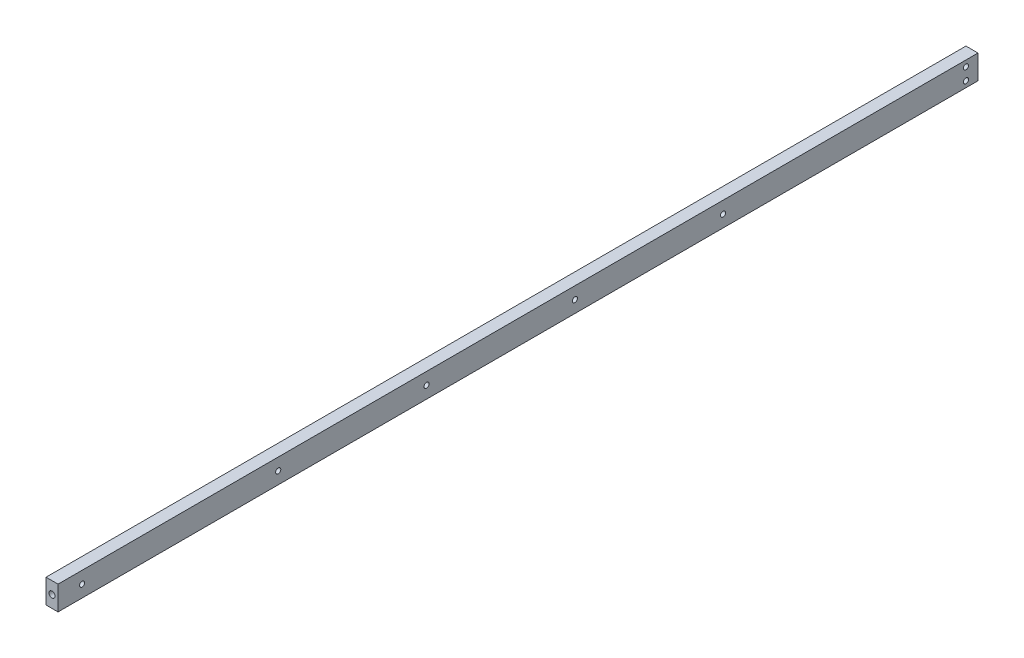
ISO-10303-21;
HEADER;
FILE_DESCRIPTION(('STEP AP214'),'2;1');
FILE_NAME('part.step','',(''),(''),'','','');
FILE_SCHEMA(('AUTOMOTIVE_DESIGN { 1 0 10303 214 1 1 1 1 }'));
ENDSEC;
DATA;
#1=APPLICATION_CONTEXT('core data for automotive mechanical design processes');
#2=APPLICATION_PROTOCOL_DEFINITION('international standard','automotive_design',2000,#1);
#3=PRODUCT_CONTEXT('',#1,'mechanical');
#4=PRODUCT('Part','Part','',(#3));
#5=PRODUCT_RELATED_PRODUCT_CATEGORY('part','',(#4));
#6=PRODUCT_DEFINITION_FORMATION('','',#4);
#7=PRODUCT_DEFINITION_CONTEXT('part definition',#1,'design');
#8=PRODUCT_DEFINITION('design','',#6,#7);
#9=PRODUCT_DEFINITION_SHAPE('','',#8);
#10=(LENGTH_UNIT() NAMED_UNIT(*) SI_UNIT(.MILLI.,.METRE.));
#11=(NAMED_UNIT(*) PLANE_ANGLE_UNIT() SI_UNIT($,.RADIAN.));
#12=(NAMED_UNIT(*) SI_UNIT($,.STERADIAN.) SOLID_ANGLE_UNIT());
#13=UNCERTAINTY_MEASURE_WITH_UNIT(LENGTH_MEASURE(1.E-05),#10,'distance_accuracy_value','');
#14=(GEOMETRIC_REPRESENTATION_CONTEXT(3) GLOBAL_UNCERTAINTY_ASSIGNED_CONTEXT((#13)) GLOBAL_UNIT_ASSIGNED_CONTEXT((#10,
#11,#12)) REPRESENTATION_CONTEXT('',''));
#15=CARTESIAN_POINT('',(0.,0.,0.));
#16=DIRECTION('',(0.,0.,1.));
#17=DIRECTION('',(1.,0.,0.));
#18=AXIS2_PLACEMENT_3D('',#15,#16,#17);
#19=CARTESIAN_POINT('',(0.,0.,485.14));
#20=DIRECTION('',(1.,0.,0.));
#21=DIRECTION('',(0.,0.,-1.));
#22=AXIS2_PLACEMENT_3D('',#19,#20,#21);
#23=PLANE('',#22);
#24=CARTESIAN_POINT('',(0.,6.35000000000008,369.033439454375));
#25=DIRECTION('',(1.,0.,0.));
#26=DIRECTION('',(0.,0.,-1.));
#27=AXIS2_PLACEMENT_3D('',#24,#25,#26);
#28=CIRCLE('',#27,1.35255);
#29=CARTESIAN_POINT('',(0.,6.35000000000008,367.680889454375));
#30=VERTEX_POINT('',#29);
#31=EDGE_CURVE('E166',#30,#30,#28,.T.);
#32=ORIENTED_EDGE('',*,*,#31,.T.);
#33=EDGE_LOOP('',(#32));
#34=FACE_BOUND('',#33,.T.);
#35=CARTESIAN_POINT('',(0.,6.35000000000008,212.569439454375));
#36=DIRECTION('',(1.,0.,0.));
#37=DIRECTION('',(0.,0.,-1.));
#38=AXIS2_PLACEMENT_3D('',#35,#36,#37);
#39=CIRCLE('',#38,1.35255);
#40=CARTESIAN_POINT('',(0.,6.35000000000008,211.216889454375));
#41=VERTEX_POINT('',#40);
#42=EDGE_CURVE('E160',#41,#41,#39,.T.);
#43=ORIENTED_EDGE('',*,*,#42,.T.);
#44=EDGE_LOOP('',(#43));
#45=FACE_BOUND('',#44,.T.);
#46=CARTESIAN_POINT('',(0.,6.35000000000008,290.801439454375));
#47=DIRECTION('',(1.,0.,0.));
#48=DIRECTION('',(0.,0.,-1.));
#49=AXIS2_PLACEMENT_3D('',#46,#47,#48);
#50=CIRCLE('',#49,1.35255);
#51=CARTESIAN_POINT('',(0.,6.35000000000008,289.448889454375));
#52=VERTEX_POINT('',#51);
#53=EDGE_CURVE('E154',#52,#52,#50,.T.);
#54=ORIENTED_EDGE('',*,*,#53,.T.);
#55=EDGE_LOOP('',(#54));
#56=FACE_BOUND('',#55,.T.);
#57=CARTESIAN_POINT('',(0.,6.35000000000008,134.430638313341));
#58=DIRECTION('',(1.,0.,0.));
#59=DIRECTION('',(0.,0.,-1.));
#60=AXIS2_PLACEMENT_3D('',#57,#58,#59);
#61=CIRCLE('',#60,1.35255);
#62=CARTESIAN_POINT('',(0.,6.35000000000008,133.078088313341));
#63=VERTEX_POINT('',#62);
#64=EDGE_CURVE('E146',#63,#63,#61,.T.);
#65=ORIENTED_EDGE('',*,*,#64,.T.);
#66=EDGE_LOOP('',(#65));
#67=FACE_BOUND('',#66,.T.);
#68=CARTESIAN_POINT('',(0.,6.35,472.44));
#69=DIRECTION('',(1.,0.,0.));
#70=DIRECTION('',(0.,0.,-1.));
#71=AXIS2_PLACEMENT_3D('',#68,#69,#70);
#72=CIRCLE('',#71,1.35255);
#73=CARTESIAN_POINT('',(0.,6.35,471.08745));
#74=VERTEX_POINT('',#73);
#75=EDGE_CURVE('E136',#74,#74,#72,.T.);
#76=ORIENTED_EDGE('',*,*,#75,.T.);
#77=EDGE_LOOP('',(#76));
#78=FACE_BOUND('',#77,.T.);
#79=CARTESIAN_POINT('',(0.,3.175,6.35000000000002));
#80=DIRECTION('',(1.,0.,0.));
#81=DIRECTION('',(0.,0.,-1.));
#82=AXIS2_PLACEMENT_3D('',#79,#80,#81);
#83=CIRCLE('',#82,1.35255);
#84=CARTESIAN_POINT('',(0.,3.175,4.99745000000002));
#85=VERTEX_POINT('',#84);
#86=EDGE_CURVE('E130',#85,#85,#83,.T.);
#87=ORIENTED_EDGE('',*,*,#86,.T.);
#88=EDGE_LOOP('',(#87));
#89=FACE_BOUND('',#88,.T.);
#90=CARTESIAN_POINT('',(0.,9.525,6.35000000000002));
#91=DIRECTION('',(1.,0.,0.));
#92=DIRECTION('',(0.,0.,-1.));
#93=AXIS2_PLACEMENT_3D('',#90,#91,#92);
#94=CIRCLE('',#93,1.35255);
#95=CARTESIAN_POINT('',(0.,9.525,4.99745000000002));
#96=VERTEX_POINT('',#95);
#97=EDGE_CURVE('E114',#96,#96,#94,.T.);
#98=ORIENTED_EDGE('',*,*,#97,.T.);
#99=EDGE_LOOP('',(#98));
#100=FACE_BOUND('',#99,.T.);
#101=DIRECTION('',(0.,-1.,0.));
#102=VECTOR('',#101,1.);
#103=CARTESIAN_POINT('',(0.,0.,0.));
#104=LINE('',#103,#102);
#105=CARTESIAN_POINT('',(0.,12.7,0.));
#106=VERTEX_POINT('',#105);
#107=CARTESIAN_POINT('',(0.,0.,0.));
#108=VERTEX_POINT('',#107);
#109=EDGE_CURVE('E111',#106,#108,#104,.T.);
#110=ORIENTED_EDGE('',*,*,#109,.T.);
#111=DIRECTION('',(0.,0.,-1.));
#112=VECTOR('',#111,1.);
#113=CARTESIAN_POINT('',(0.,0.,485.14));
#114=LINE('',#113,#112);
#115=CARTESIAN_POINT('',(0.,0.,485.14));
#116=VERTEX_POINT('',#115);
#117=EDGE_CURVE('E13',#116,#108,#114,.T.);
#118=ORIENTED_EDGE('',*,*,#117,.F.);
#119=DIRECTION('',(0.,-1.,0.));
#120=VECTOR('',#119,1.);
#121=CARTESIAN_POINT('',(0.,0.,485.14));
#122=LINE('',#121,#120);
#123=CARTESIAN_POINT('',(0.,12.7,485.14));
#124=VERTEX_POINT('',#123);
#125=EDGE_CURVE('E99',#124,#116,#122,.T.);
#126=ORIENTED_EDGE('',*,*,#125,.F.);
#127=DIRECTION('',(0.,0.,-1.));
#128=VECTOR('',#127,1.);
#129=CARTESIAN_POINT('',(0.,12.7,485.14));
#130=LINE('',#129,#128);
#131=EDGE_CURVE('E107',#124,#106,#130,.T.);
#132=ORIENTED_EDGE('',*,*,#131,.T.);
#133=EDGE_LOOP('',(#110,#118,#126,#132));
#134=FACE_BOUND('',#133,.T.);
#135=ADVANCED_FACE('F48',(#34,#45,#56,#67,#78,#89,#100,#134),#23,.F.);
#136=CARTESIAN_POINT('',(0.,0.,485.14));
#137=DIRECTION('',(0.,1.,0.));
#138=DIRECTION('',(0.,0.,1.));
#139=AXIS2_PLACEMENT_3D('',#136,#137,#138);
#140=PLANE('',#139);
#141=DIRECTION('',(1.,0.,0.));
#142=VECTOR('',#141,1.);
#143=CARTESIAN_POINT('',(0.,0.,0.));
#144=LINE('',#143,#142);
#145=CARTESIAN_POINT('',(6.35,0.,0.));
#146=VERTEX_POINT('',#145);
#147=EDGE_CURVE('E103',#108,#146,#144,.T.);
#148=ORIENTED_EDGE('',*,*,#147,.T.);
#149=DIRECTION('',(0.,0.,-1.));
#150=VECTOR('',#149,1.);
#151=CARTESIAN_POINT('',(6.35,0.,485.14));
#152=LINE('',#151,#150);
#153=CARTESIAN_POINT('',(6.35,0.,485.14));
#154=VERTEX_POINT('',#153);
#155=EDGE_CURVE('E56',#154,#146,#152,.T.);
#156=ORIENTED_EDGE('',*,*,#155,.F.);
#157=DIRECTION('',(1.,0.,0.));
#158=VECTOR('',#157,1.);
#159=CARTESIAN_POINT('',(0.,0.,485.14));
#160=LINE('',#159,#158);
#161=EDGE_CURVE('E94',#116,#154,#160,.T.);
#162=ORIENTED_EDGE('',*,*,#161,.F.);
#163=ORIENTED_EDGE('',*,*,#117,.T.);
#164=EDGE_LOOP('',(#148,#156,#162,#163));
#165=FACE_BOUND('',#164,.T.);
#166=ADVANCED_FACE('F102',(#165),#140,.F.);
#167=CARTESIAN_POINT('',(6.35,0.,485.14));
#168=DIRECTION('',(-1.,0.,0.));
#169=DIRECTION('',(0.,-1.,0.));
#170=AXIS2_PLACEMENT_3D('',#167,#168,#169);
#171=PLANE('',#170);
#172=CARTESIAN_POINT('',(6.35,6.35000000000008,369.033439454375));
#173=DIRECTION('',(-1.,0.,0.));
#174=DIRECTION('',(0.,0.,1.));
#175=AXIS2_PLACEMENT_3D('',#172,#173,#174);
#176=CIRCLE('',#175,1.35254999999999);
#177=CARTESIAN_POINT('',(6.35,6.35000000000008,370.385989454375));
#178=VERTEX_POINT('',#177);
#179=EDGE_CURVE('E169',#178,#178,#176,.T.);
#180=ORIENTED_EDGE('',*,*,#179,.T.);
#181=EDGE_LOOP('',(#180));
#182=FACE_BOUND('',#181,.T.);
#183=CARTESIAN_POINT('',(6.35,6.35000000000008,212.569439454375));
#184=DIRECTION('',(-1.,0.,0.));
#185=DIRECTION('',(0.,0.,1.));
#186=AXIS2_PLACEMENT_3D('',#183,#184,#185);
#187=CIRCLE('',#186,1.35254999999999);
#188=CARTESIAN_POINT('',(6.35,6.35000000000008,213.921989454375));
#189=VERTEX_POINT('',#188);
#190=EDGE_CURVE('E163',#189,#189,#187,.T.);
#191=ORIENTED_EDGE('',*,*,#190,.T.);
#192=EDGE_LOOP('',(#191));
#193=FACE_BOUND('',#192,.T.);
#194=CARTESIAN_POINT('',(6.35,6.35000000000008,290.801439454375));
#195=DIRECTION('',(-1.,0.,0.));
#196=DIRECTION('',(0.,0.,1.));
#197=AXIS2_PLACEMENT_3D('',#194,#195,#196);
#198=CIRCLE('',#197,1.35254999999999);
#199=CARTESIAN_POINT('',(6.35,6.35000000000008,292.153989454375));
#200=VERTEX_POINT('',#199);
#201=EDGE_CURVE('E157',#200,#200,#198,.T.);
#202=ORIENTED_EDGE('',*,*,#201,.T.);
#203=EDGE_LOOP('',(#202));
#204=FACE_BOUND('',#203,.T.);
#205=CARTESIAN_POINT('',(6.35,6.35000000000008,134.430638313341));
#206=DIRECTION('',(-1.,0.,0.));
#207=DIRECTION('',(0.,0.,1.));
#208=AXIS2_PLACEMENT_3D('',#205,#206,#207);
#209=CIRCLE('',#208,1.35254999999999);
#210=CARTESIAN_POINT('',(6.35,6.35000000000008,135.783188313341));
#211=VERTEX_POINT('',#210);
#212=EDGE_CURVE('E151',#211,#211,#209,.T.);
#213=ORIENTED_EDGE('',*,*,#212,.T.);
#214=EDGE_LOOP('',(#213));
#215=FACE_BOUND('',#214,.T.);
#216=CARTESIAN_POINT('',(6.35,6.35,472.44));
#217=DIRECTION('',(1.,0.,0.));
#218=DIRECTION('',(0.,0.,-1.));
#219=AXIS2_PLACEMENT_3D('',#216,#217,#218);
#220=CIRCLE('',#219,1.35255);
#221=CARTESIAN_POINT('',(6.35,6.35,471.08745));
#222=VERTEX_POINT('',#221);
#223=EDGE_CURVE('E139',#222,#222,#220,.T.);
#224=ORIENTED_EDGE('',*,*,#223,.F.);
#225=EDGE_LOOP('',(#224));
#226=FACE_BOUND('',#225,.T.);
#227=CARTESIAN_POINT('',(6.35,3.175,6.35000000000002));
#228=DIRECTION('',(1.,0.,0.));
#229=DIRECTION('',(0.,0.,-1.));
#230=AXIS2_PLACEMENT_3D('',#227,#228,#229);
#231=CIRCLE('',#230,1.35255);
#232=CARTESIAN_POINT('',(6.35,3.175,4.99745000000002));
#233=VERTEX_POINT('',#232);
#234=EDGE_CURVE('E133',#233,#233,#231,.T.);
#235=ORIENTED_EDGE('',*,*,#234,.F.);
#236=EDGE_LOOP('',(#235));
#237=FACE_BOUND('',#236,.T.);
#238=CARTESIAN_POINT('',(6.35,9.525,6.35000000000002));
#239=DIRECTION('',(1.,0.,0.));
#240=DIRECTION('',(0.,0.,-1.));
#241=AXIS2_PLACEMENT_3D('',#238,#239,#240);
#242=CIRCLE('',#241,1.35255);
#243=CARTESIAN_POINT('',(6.35,9.525,4.99745000000002));
#244=VERTEX_POINT('',#243);
#245=EDGE_CURVE('E127',#244,#244,#242,.T.);
#246=ORIENTED_EDGE('',*,*,#245,.F.);
#247=EDGE_LOOP('',(#246));
#248=FACE_BOUND('',#247,.T.);
#249=DIRECTION('',(0.,1.,0.));
#250=VECTOR('',#249,1.);
#251=CARTESIAN_POINT('',(6.35,0.,0.));
#252=LINE('',#251,#250);
#253=CARTESIAN_POINT('',(6.35,12.7,0.));
#254=VERTEX_POINT('',#253);
#255=EDGE_CURVE('E81',#146,#254,#252,.T.);
#256=ORIENTED_EDGE('',*,*,#255,.T.);
#257=DIRECTION('',(0.,0.,-1.));
#258=VECTOR('',#257,1.);
#259=CARTESIAN_POINT('',(6.35,12.7,485.14));
#260=LINE('',#259,#258);
#261=CARTESIAN_POINT('',(6.35,12.7,485.14));
#262=VERTEX_POINT('',#261);
#263=EDGE_CURVE('E104',#262,#254,#260,.T.);
#264=ORIENTED_EDGE('',*,*,#263,.F.);
#265=DIRECTION('',(0.,1.,0.));
#266=VECTOR('',#265,1.);
#267=CARTESIAN_POINT('',(6.35,0.,485.14));
#268=LINE('',#267,#266);
#269=EDGE_CURVE('E97',#154,#262,#268,.T.);
#270=ORIENTED_EDGE('',*,*,#269,.F.);
#271=ORIENTED_EDGE('',*,*,#155,.T.);
#272=EDGE_LOOP('',(#256,#264,#270,#271));
#273=FACE_BOUND('',#272,.T.);
#274=ADVANCED_FACE('F105',(#182,#193,#204,#215,#226,#237,#248,#273),#171,.F.);
#275=CARTESIAN_POINT('',(0.,12.7,485.14));
#276=DIRECTION('',(0.,-1.,0.));
#277=DIRECTION('',(0.,0.,-1.));
#278=AXIS2_PLACEMENT_3D('',#275,#276,#277);
#279=PLANE('',#278);
#280=DIRECTION('',(-1.,0.,0.));
#281=VECTOR('',#280,1.);
#282=CARTESIAN_POINT('',(0.,12.7,0.));
#283=LINE('',#282,#281);
#284=EDGE_CURVE('E87',#254,#106,#283,.T.);
#285=ORIENTED_EDGE('',*,*,#284,.T.);
#286=ORIENTED_EDGE('',*,*,#131,.F.);
#287=DIRECTION('',(-1.,0.,0.));
#288=VECTOR('',#287,1.);
#289=CARTESIAN_POINT('',(0.,12.7,485.14));
#290=LINE('',#289,#288);
#291=EDGE_CURVE('E64',#262,#124,#290,.T.);
#292=ORIENTED_EDGE('',*,*,#291,.F.);
#293=ORIENTED_EDGE('',*,*,#263,.T.);
#294=EDGE_LOOP('',(#285,#286,#292,#293));
#295=FACE_BOUND('',#294,.T.);
#296=ADVANCED_FACE('F119',(#295),#279,.F.);
#297=CARTESIAN_POINT('',(0.,0.,485.14));
#298=DIRECTION('',(0.,0.,-1.));
#299=DIRECTION('',(-1.,0.,0.));
#300=AXIS2_PLACEMENT_3D('',#297,#298,#299);
#301=PLANE('',#300);
#302=CARTESIAN_POINT('',(3.175,6.35,485.14));
#303=DIRECTION('',(0.,0.,1.));
#304=DIRECTION('',(1.,0.,0.));
#305=AXIS2_PLACEMENT_3D('',#302,#303,#304);
#306=CIRCLE('',#305,1.5875);
#307=CARTESIAN_POINT('',(4.7625,6.35,485.14));
#308=VERTEX_POINT('',#307);
#309=EDGE_CURVE('E143',#308,#308,#306,.T.);
#310=ORIENTED_EDGE('',*,*,#309,.F.);
#311=EDGE_LOOP('',(#310));
#312=FACE_BOUND('',#311,.T.);
#313=ORIENTED_EDGE('',*,*,#125,.T.);
#314=ORIENTED_EDGE('',*,*,#161,.T.);
#315=ORIENTED_EDGE('',*,*,#269,.T.);
#316=ORIENTED_EDGE('',*,*,#291,.T.);
#317=EDGE_LOOP('',(#313,#314,#315,#316));
#318=FACE_BOUND('',#317,.T.);
#319=ADVANCED_FACE('F95',(#312,#318),#301,.F.);
#320=CARTESIAN_POINT('',(0.,0.,0.));
#321=DIRECTION('',(0.,0.,-1.));
#322=DIRECTION('',(-1.,0.,0.));
#323=AXIS2_PLACEMENT_3D('',#320,#321,#322);
#324=PLANE('',#323);
#325=ORIENTED_EDGE('',*,*,#109,.F.);
#326=ORIENTED_EDGE('',*,*,#284,.F.);
#327=ORIENTED_EDGE('',*,*,#255,.F.);
#328=ORIENTED_EDGE('',*,*,#147,.F.);
#329=EDGE_LOOP('',(#325,#326,#327,#328));
#330=FACE_BOUND('',#329,.T.);
#331=ADVANCED_FACE('F122',(#330),#324,.T.);
#332=CARTESIAN_POINT('',(6.35,9.525,6.35000000000002));
#333=DIRECTION('',(1.,0.,0.));
#334=DIRECTION('',(0.,0.,-1.));
#335=AXIS2_PLACEMENT_3D('',#332,#333,#334);
#336=CYLINDRICAL_SURFACE('',#335,1.35255);
#337=ORIENTED_EDGE('',*,*,#97,.F.);
#338=EDGE_LOOP('',(#337));
#339=FACE_BOUND('',#338,.T.);
#340=ORIENTED_EDGE('',*,*,#245,.T.);
#341=EDGE_LOOP('',(#340));
#342=FACE_BOUND('',#341,.T.);
#343=ADVANCED_FACE('F196',(#339,#342),#336,.F.);
#344=CARTESIAN_POINT('',(6.35,3.175,6.35000000000002));
#345=DIRECTION('',(1.,0.,0.));
#346=DIRECTION('',(0.,0.,-1.));
#347=AXIS2_PLACEMENT_3D('',#344,#345,#346);
#348=CYLINDRICAL_SURFACE('',#347,1.35255);
#349=ORIENTED_EDGE('',*,*,#86,.F.);
#350=EDGE_LOOP('',(#349));
#351=FACE_BOUND('',#350,.T.);
#352=ORIENTED_EDGE('',*,*,#234,.T.);
#353=EDGE_LOOP('',(#352));
#354=FACE_BOUND('',#353,.T.);
#355=ADVANCED_FACE('F199',(#351,#354),#348,.F.);
#356=CARTESIAN_POINT('',(6.35,6.35,472.44));
#357=DIRECTION('',(1.,0.,0.));
#358=DIRECTION('',(0.,0.,-1.));
#359=AXIS2_PLACEMENT_3D('',#356,#357,#358);
#360=CYLINDRICAL_SURFACE('',#359,1.35255);
#361=ORIENTED_EDGE('',*,*,#75,.F.);
#362=EDGE_LOOP('',(#361));
#363=FACE_BOUND('',#362,.T.);
#364=ORIENTED_EDGE('',*,*,#223,.T.);
#365=EDGE_LOOP('',(#364));
#366=FACE_BOUND('',#365,.T.);
#367=ADVANCED_FACE('F218',(#363,#366),#360,.F.);
#368=CARTESIAN_POINT('',(3.175,6.35,478.79));
#369=DIRECTION('',(0.,0.,1.));
#370=DIRECTION('',(1.,0.,0.));
#371=AXIS2_PLACEMENT_3D('',#368,#369,#370);
#372=CYLINDRICAL_SURFACE('',#371,1.5875);
#373=CARTESIAN_POINT('',(3.175,6.35,478.79));
#374=DIRECTION('',(0.,0.,1.));
#375=DIRECTION('',(1.,0.,0.));
#376=AXIS2_PLACEMENT_3D('',#373,#374,#375);
#377=CIRCLE('',#376,1.5875);
#378=CARTESIAN_POINT('',(4.7625,6.35,478.79));
#379=VERTEX_POINT('',#378);
#380=EDGE_CURVE('E142',#379,#379,#377,.T.);
#381=ORIENTED_EDGE('',*,*,#380,.F.);
#382=EDGE_LOOP('',(#381));
#383=FACE_BOUND('',#382,.T.);
#384=ORIENTED_EDGE('',*,*,#309,.T.);
#385=EDGE_LOOP('',(#384));
#386=FACE_BOUND('',#385,.T.);
#387=ADVANCED_FACE('F222',(#383,#386),#372,.F.);
#388=CARTESIAN_POINT('',(3.175,6.35,478.79));
#389=DIRECTION('',(0.,0.,1.));
#390=DIRECTION('',(1.,0.,0.));
#391=AXIS2_PLACEMENT_3D('',#388,#389,#390);
#392=PLANE('',#391);
#393=ORIENTED_EDGE('',*,*,#380,.T.);
#394=EDGE_LOOP('',(#393));
#395=FACE_BOUND('',#394,.T.);
#396=ADVANCED_FACE('F226',(#395),#392,.T.);
#397=CARTESIAN_POINT('',(-13.4937500000001,6.35000000000008,134.430638313341));
#398=DIRECTION('',(-1.,0.,0.));
#399=DIRECTION('',(0.,0.,1.));
#400=AXIS2_PLACEMENT_3D('',#397,#398,#399);
#401=CYLINDRICAL_SURFACE('',#400,1.35255);
#402=ORIENTED_EDGE('',*,*,#212,.F.);
#403=EDGE_LOOP('',(#402));
#404=FACE_BOUND('',#403,.T.);
#405=ORIENTED_EDGE('',*,*,#64,.F.);
#406=EDGE_LOOP('',(#405));
#407=FACE_BOUND('',#406,.T.);
#408=ADVANCED_FACE('F230',(#404,#407),#401,.F.);
#409=CARTESIAN_POINT('',(-13.4937500000001,6.35000000000008,290.801439454375));
#410=DIRECTION('',(-1.,0.,0.));
#411=DIRECTION('',(0.,0.,1.));
#412=AXIS2_PLACEMENT_3D('',#409,#410,#411);
#413=CYLINDRICAL_SURFACE('',#412,1.35255);
#414=ORIENTED_EDGE('',*,*,#201,.F.);
#415=EDGE_LOOP('',(#414));
#416=FACE_BOUND('',#415,.T.);
#417=ORIENTED_EDGE('',*,*,#53,.F.);
#418=EDGE_LOOP('',(#417));
#419=FACE_BOUND('',#418,.T.);
#420=ADVANCED_FACE('F234',(#416,#419),#413,.F.);
#421=CARTESIAN_POINT('',(-13.4937500000001,6.35000000000008,212.569439454375));
#422=DIRECTION('',(-1.,0.,0.));
#423=DIRECTION('',(0.,0.,1.));
#424=AXIS2_PLACEMENT_3D('',#421,#422,#423);
#425=CYLINDRICAL_SURFACE('',#424,1.35255);
#426=ORIENTED_EDGE('',*,*,#190,.F.);
#427=EDGE_LOOP('',(#426));
#428=FACE_BOUND('',#427,.T.);
#429=ORIENTED_EDGE('',*,*,#42,.F.);
#430=EDGE_LOOP('',(#429));
#431=FACE_BOUND('',#430,.T.);
#432=ADVANCED_FACE('F178',(#428,#431),#425,.F.);
#433=CARTESIAN_POINT('',(-13.4937500000001,6.35000000000008,369.033439454375));
#434=DIRECTION('',(-1.,0.,0.));
#435=DIRECTION('',(0.,0.,1.));
#436=AXIS2_PLACEMENT_3D('',#433,#434,#435);
#437=CYLINDRICAL_SURFACE('',#436,1.35255);
#438=ORIENTED_EDGE('',*,*,#179,.F.);
#439=EDGE_LOOP('',(#438));
#440=FACE_BOUND('',#439,.T.);
#441=ORIENTED_EDGE('',*,*,#31,.F.);
#442=EDGE_LOOP('',(#441));
#443=FACE_BOUND('',#442,.T.);
#444=ADVANCED_FACE('F175',(#440,#443),#437,.F.);
#445=CLOSED_SHELL('',(#135,#166,#274,#296,#319,#331,#343,#355,#367,#387,#396,#408,#420,#432,#444));
#446=MANIFOLD_SOLID_BREP('B2',#445);
#447=ADVANCED_BREP_SHAPE_REPRESENTATION('',(#18,#446),#14);
#448=SHAPE_DEFINITION_REPRESENTATION(#9,#447);
ENDSEC;
END-ISO-10303-21;
